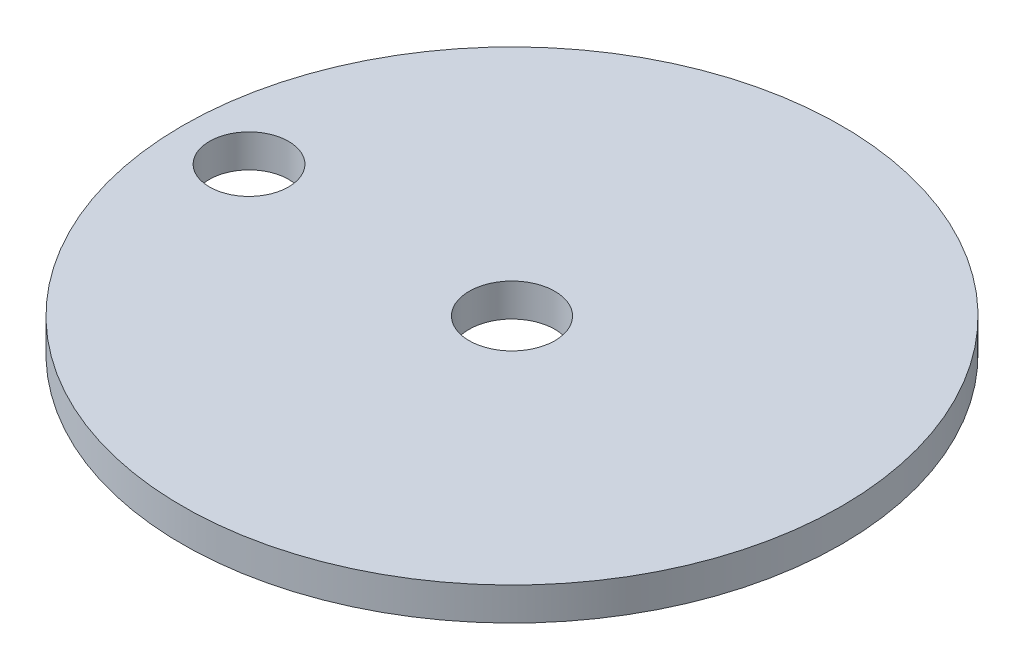
ISO-10303-21;
HEADER;
FILE_DESCRIPTION(('STEP AP214'),'2;1');
FILE_NAME('part.step','',(''),(''),'','','');
FILE_SCHEMA(('AUTOMOTIVE_DESIGN { 1 0 10303 214 1 1 1 1 }'));
ENDSEC;
DATA;
#1=APPLICATION_CONTEXT('core data for automotive mechanical design processes');
#2=APPLICATION_PROTOCOL_DEFINITION('international standard','automotive_design',2000,#1);
#3=PRODUCT_CONTEXT('',#1,'mechanical');
#4=PRODUCT('Part','Part','',(#3));
#5=PRODUCT_RELATED_PRODUCT_CATEGORY('part','',(#4));
#6=PRODUCT_DEFINITION_FORMATION('','',#4);
#7=PRODUCT_DEFINITION_CONTEXT('part definition',#1,'design');
#8=PRODUCT_DEFINITION('design','',#6,#7);
#9=PRODUCT_DEFINITION_SHAPE('','',#8);
#10=(LENGTH_UNIT() NAMED_UNIT(*) SI_UNIT(.MILLI.,.METRE.));
#11=(NAMED_UNIT(*) PLANE_ANGLE_UNIT() SI_UNIT($,.RADIAN.));
#12=(NAMED_UNIT(*) SI_UNIT($,.STERADIAN.) SOLID_ANGLE_UNIT());
#13=UNCERTAINTY_MEASURE_WITH_UNIT(LENGTH_MEASURE(1.E-05),#10,'distance_accuracy_value','');
#14=(GEOMETRIC_REPRESENTATION_CONTEXT(3) GLOBAL_UNCERTAINTY_ASSIGNED_CONTEXT((#13)) GLOBAL_UNIT_ASSIGNED_CONTEXT((#10,
#11,#12)) REPRESENTATION_CONTEXT('',''));
#15=CARTESIAN_POINT('',(0.,0.,0.));
#16=DIRECTION('',(0.,0.,1.));
#17=DIRECTION('',(1.,0.,0.));
#18=AXIS2_PLACEMENT_3D('',#15,#16,#17);
#19=CARTESIAN_POINT('',(0.,-10.,0.));
#20=DIRECTION('',(0.,1.,0.));
#21=DIRECTION('',(-1.,0.,0.));
#22=AXIS2_PLACEMENT_3D('',#19,#20,#21);
#23=CYLINDRICAL_SURFACE('',#22,100.);
#24=CARTESIAN_POINT('',(0.,-10.,0.));
#25=DIRECTION('',(0.,-1.,0.));
#26=DIRECTION('',(1.,0.,0.));
#27=AXIS2_PLACEMENT_3D('',#24,#25,#26);
#28=CIRCLE('',#27,100.);
#29=CARTESIAN_POINT('',(100.,-10.,0.));
#30=VERTEX_POINT('',#29);
#31=EDGE_CURVE('E10',#30,#30,#28,.T.);
#32=ORIENTED_EDGE('',*,*,#31,.F.);
#33=EDGE_LOOP('',(#32));
#34=FACE_BOUND('',#33,.T.);
#35=CARTESIAN_POINT('',(0.,0.,0.));
#36=DIRECTION('',(0.,-1.,0.));
#37=DIRECTION('',(1.,0.,0.));
#38=AXIS2_PLACEMENT_3D('',#35,#36,#37);
#39=CIRCLE('',#38,100.);
#40=CARTESIAN_POINT('',(100.,0.,0.));
#41=VERTEX_POINT('',#40);
#42=EDGE_CURVE('E22',#41,#41,#39,.T.);
#43=ORIENTED_EDGE('',*,*,#42,.T.);
#44=EDGE_LOOP('',(#43));
#45=FACE_BOUND('',#44,.T.);
#46=ADVANCED_FACE('F15',(#34,#45),#23,.T.);
#47=CARTESIAN_POINT('',(0.,-10.,0.));
#48=DIRECTION('',(0.,-1.,0.));
#49=DIRECTION('',(1.,0.,0.));
#50=AXIS2_PLACEMENT_3D('',#47,#48,#49);
#51=PLANE('',#50);
#52=CARTESIAN_POINT('',(0.,-10.,0.));
#53=DIRECTION('',(0.,-1.,0.));
#54=DIRECTION('',(1.,0.,0.));
#55=AXIS2_PLACEMENT_3D('',#52,#53,#54);
#56=CIRCLE('',#55,13.);
#57=CARTESIAN_POINT('',(13.,-10.,0.));
#58=VERTEX_POINT('',#57);
#59=EDGE_CURVE('E29',#58,#58,#56,.T.);
#60=ORIENTED_EDGE('',*,*,#59,.F.);
#61=EDGE_LOOP('',(#60));
#62=FACE_BOUND('',#61,.T.);
#63=CARTESIAN_POINT('',(-79.8,-10.,0.));
#64=DIRECTION('',(0.,-1.,0.));
#65=DIRECTION('',(1.,0.,0.));
#66=AXIS2_PLACEMENT_3D('',#63,#64,#65);
#67=CIRCLE('',#66,12.);
#68=CARTESIAN_POINT('',(-67.8,-10.,0.));
#69=VERTEX_POINT('',#68);
#70=EDGE_CURVE('E35',#69,#69,#67,.F.);
#71=ORIENTED_EDGE('',*,*,#70,.T.);
#72=EDGE_LOOP('',(#71));
#73=FACE_BOUND('',#72,.T.);
#74=ORIENTED_EDGE('',*,*,#31,.T.);
#75=EDGE_LOOP('',(#74));
#76=FACE_BOUND('',#75,.T.);
#77=ADVANCED_FACE('F67',(#62,#73,#76),#51,.T.);
#78=CARTESIAN_POINT('',(0.,0.,0.));
#79=DIRECTION('',(0.,-1.,0.));
#80=DIRECTION('',(1.,0.,0.));
#81=AXIS2_PLACEMENT_3D('',#78,#79,#80);
#82=PLANE('',#81);
#83=CARTESIAN_POINT('',(0.,0.,0.));
#84=DIRECTION('',(0.,-1.,0.));
#85=DIRECTION('',(1.,0.,0.));
#86=AXIS2_PLACEMENT_3D('',#83,#84,#85);
#87=CIRCLE('',#86,13.);
#88=CARTESIAN_POINT('',(13.,0.,0.));
#89=VERTEX_POINT('',#88);
#90=EDGE_CURVE('E41',#89,#89,#87,.T.);
#91=ORIENTED_EDGE('',*,*,#90,.T.);
#92=EDGE_LOOP('',(#91));
#93=FACE_BOUND('',#92,.T.);
#94=CARTESIAN_POINT('',(-79.8,0.,0.));
#95=DIRECTION('',(0.,-1.,0.));
#96=DIRECTION('',(1.,0.,0.));
#97=AXIS2_PLACEMENT_3D('',#94,#95,#96);
#98=CIRCLE('',#97,12.);
#99=CARTESIAN_POINT('',(-67.8,0.,0.));
#100=VERTEX_POINT('',#99);
#101=EDGE_CURVE('E45',#100,#100,#98,.T.);
#102=ORIENTED_EDGE('',*,*,#101,.T.);
#103=EDGE_LOOP('',(#102));
#104=FACE_BOUND('',#103,.T.);
#105=ORIENTED_EDGE('',*,*,#42,.F.);
#106=EDGE_LOOP('',(#105));
#107=FACE_BOUND('',#106,.T.);
#108=ADVANCED_FACE('F52',(#93,#104,#107),#82,.F.);
#109=CARTESIAN_POINT('',(-79.8,-15.,0.));
#110=DIRECTION('',(0.,1.,0.));
#111=DIRECTION('',(-1.,0.,0.));
#112=AXIS2_PLACEMENT_3D('',#109,#110,#111);
#113=CYLINDRICAL_SURFACE('',#112,12.);
#114=ORIENTED_EDGE('',*,*,#70,.F.);
#115=EDGE_LOOP('',(#114));
#116=FACE_BOUND('',#115,.T.);
#117=ORIENTED_EDGE('',*,*,#101,.F.);
#118=EDGE_LOOP('',(#117));
#119=FACE_BOUND('',#118,.T.);
#120=ADVANCED_FACE('F55',(#116,#119),#113,.F.);
#121=CARTESIAN_POINT('',(0.,0.,0.));
#122=DIRECTION('',(0.,-1.,0.));
#123=DIRECTION('',(1.,0.,0.));
#124=AXIS2_PLACEMENT_3D('',#121,#122,#123);
#125=CYLINDRICAL_SURFACE('',#124,13.);
#126=ORIENTED_EDGE('',*,*,#90,.F.);
#127=EDGE_LOOP('',(#126));
#128=FACE_BOUND('',#127,.T.);
#129=ORIENTED_EDGE('',*,*,#59,.T.);
#130=EDGE_LOOP('',(#129));
#131=FACE_BOUND('',#130,.T.);
#132=ADVANCED_FACE('F57',(#128,#131),#125,.F.);
#133=CLOSED_SHELL('',(#46,#77,#108,#120,#132));
#134=MANIFOLD_SOLID_BREP('B1',#133);
#135=ADVANCED_BREP_SHAPE_REPRESENTATION('',(#18,#134),#14);
#136=SHAPE_DEFINITION_REPRESENTATION(#9,#135);
ENDSEC;
END-ISO-10303-21;
